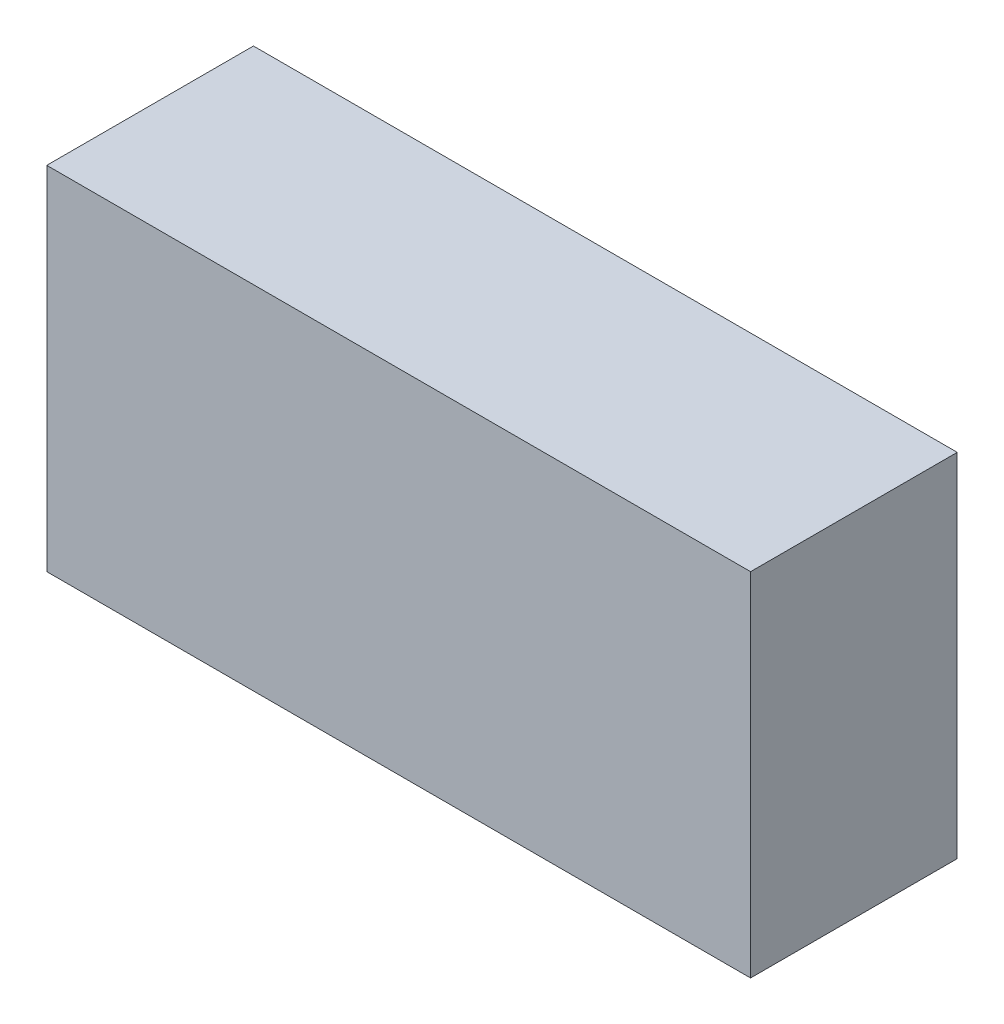
ISO-10303-21;
HEADER;
FILE_DESCRIPTION(('STEP AP214'),'2;1');
FILE_NAME('part.step','',(''),(''),'','','');
FILE_SCHEMA(('AUTOMOTIVE_DESIGN { 1 0 10303 214 1 1 1 1 }'));
ENDSEC;
DATA;
#1=APPLICATION_CONTEXT('core data for automotive mechanical design processes');
#2=APPLICATION_PROTOCOL_DEFINITION('international standard','automotive_design',2000,#1);
#3=PRODUCT_CONTEXT('',#1,'mechanical');
#4=PRODUCT('Part','Part','',(#3));
#5=PRODUCT_RELATED_PRODUCT_CATEGORY('part','',(#4));
#6=PRODUCT_DEFINITION_FORMATION('','',#4);
#7=PRODUCT_DEFINITION_CONTEXT('part definition',#1,'design');
#8=PRODUCT_DEFINITION('design','',#6,#7);
#9=PRODUCT_DEFINITION_SHAPE('','',#8);
#10=(LENGTH_UNIT() NAMED_UNIT(*) SI_UNIT(.MILLI.,.METRE.));
#11=(NAMED_UNIT(*) PLANE_ANGLE_UNIT() SI_UNIT($,.RADIAN.));
#12=(NAMED_UNIT(*) SI_UNIT($,.STERADIAN.) SOLID_ANGLE_UNIT());
#13=UNCERTAINTY_MEASURE_WITH_UNIT(LENGTH_MEASURE(1.E-05),#10,'distance_accuracy_value','');
#14=(GEOMETRIC_REPRESENTATION_CONTEXT(3) GLOBAL_UNCERTAINTY_ASSIGNED_CONTEXT((#13)) GLOBAL_UNIT_ASSIGNED_CONTEXT((#10,
#11,#12)) REPRESENTATION_CONTEXT('',''));
#15=CARTESIAN_POINT('',(0.,0.,0.));
#16=DIRECTION('',(0.,0.,1.));
#17=DIRECTION('',(1.,0.,0.));
#18=AXIS2_PLACEMENT_3D('',#15,#16,#17);
#19=CARTESIAN_POINT('',(-1.60020254,0.80010508,0.));
#20=DIRECTION('',(0.,1.,0.));
#21=DIRECTION('',(1.,0.,0.));
#22=AXIS2_PLACEMENT_3D('',#19,#20,#21);
#23=PLANE('',#22);
#24=DIRECTION('',(0.,0.,1.));
#25=VECTOR('',#24,1.);
#26=CARTESIAN_POINT('',(-1.60020254,0.80010508,0.));
#27=LINE('',#26,#25);
#28=CARTESIAN_POINT('',(-1.60020254,0.80010508,0.));
#29=VERTEX_POINT('',#28);
#30=CARTESIAN_POINT('',(-1.60020254,0.80010508,0.9398));
#31=VERTEX_POINT('',#30);
#32=EDGE_CURVE('E11',#29,#31,#27,.T.);
#33=ORIENTED_EDGE('',*,*,#32,.T.);
#34=DIRECTION('',(1.,0.,0.));
#35=VECTOR('',#34,1.);
#36=CARTESIAN_POINT('',(-1.60020254,0.80010508,0.9398));
#37=LINE('',#36,#35);
#38=CARTESIAN_POINT('',(1.60020254,0.80010508,0.9398));
#39=VERTEX_POINT('',#38);
#40=EDGE_CURVE('E24',#31,#39,#37,.T.);
#41=ORIENTED_EDGE('',*,*,#40,.T.);
#42=DIRECTION('',(0.,0.,1.));
#43=VECTOR('',#42,1.);
#44=CARTESIAN_POINT('',(1.60020254,0.80010508,0.));
#45=LINE('',#44,#43);
#46=CARTESIAN_POINT('',(1.60020254,0.80010508,0.));
#47=VERTEX_POINT('',#46);
#48=EDGE_CURVE('E85',#47,#39,#45,.T.);
#49=ORIENTED_EDGE('',*,*,#48,.F.);
#50=DIRECTION('',(1.,0.,0.));
#51=VECTOR('',#50,1.);
#52=CARTESIAN_POINT('',(-1.60020254,0.80010508,0.));
#53=LINE('',#52,#51);
#54=EDGE_CURVE('E83',#29,#47,#53,.T.);
#55=ORIENTED_EDGE('',*,*,#54,.F.);
#56=EDGE_LOOP('',(#33,#41,#49,#55));
#57=FACE_BOUND('',#56,.T.);
#58=ADVANCED_FACE('F17',(#57),#23,.T.);
#59=CARTESIAN_POINT('',(1.60020254,0.80010508,0.));
#60=DIRECTION('',(0.99999999999874,1.58730159430359E-06,0.));
#61=DIRECTION('',(1.58730159430359E-06,-0.99999999999874,0.));
#62=AXIS2_PLACEMENT_3D('',#59,#60,#61);
#63=PLANE('',#62);
#64=ORIENTED_EDGE('',*,*,#48,.T.);
#65=DIRECTION('',(1.58730159430359E-06,-0.99999999999874,0.));
#66=VECTOR('',#65,1.);
#67=CARTESIAN_POINT('',(1.60020254,0.80010508,0.9398));
#68=LINE('',#67,#66);
#69=CARTESIAN_POINT('',(1.60020508,-0.80009492,0.9398));
#70=VERTEX_POINT('',#69);
#71=EDGE_CURVE('E81',#39,#70,#68,.T.);
#72=ORIENTED_EDGE('',*,*,#71,.T.);
#73=DIRECTION('',(0.,0.,1.));
#74=VECTOR('',#73,1.);
#75=CARTESIAN_POINT('',(1.60020508,-0.80009492,0.));
#76=LINE('',#75,#74);
#77=CARTESIAN_POINT('',(1.60020508,-0.80009492,0.));
#78=VERTEX_POINT('',#77);
#79=EDGE_CURVE('E79',#78,#70,#76,.T.);
#80=ORIENTED_EDGE('',*,*,#79,.F.);
#81=DIRECTION('',(1.58730159430359E-06,-0.99999999999874,0.));
#82=VECTOR('',#81,1.);
#83=CARTESIAN_POINT('',(1.60020254,0.80010508,0.));
#84=LINE('',#83,#82);
#85=EDGE_CURVE('E70',#47,#78,#84,.T.);
#86=ORIENTED_EDGE('',*,*,#85,.F.);
#87=EDGE_LOOP('',(#64,#72,#80,#86));
#88=FACE_BOUND('',#87,.T.);
#89=ADVANCED_FACE('F90',(#88),#63,.T.);
#90=CARTESIAN_POINT('',(1.60020508,-0.80009492,0.));
#91=DIRECTION('',(2.38094859884839E-06,-0.999999999997166,0.));
#92=DIRECTION('',(-0.999999999997166,-2.38094859884839E-06,0.));
#93=AXIS2_PLACEMENT_3D('',#90,#91,#92);
#94=PLANE('',#93);
#95=ORIENTED_EDGE('',*,*,#79,.T.);
#96=DIRECTION('',(-0.999999999997166,-2.38094859884839E-06,0.));
#97=VECTOR('',#96,1.);
#98=CARTESIAN_POINT('',(1.60020508,-0.80009492,0.9398));
#99=LINE('',#98,#97);
#100=CARTESIAN_POINT('',(-1.6002,-0.80010254,0.9398));
#101=VERTEX_POINT('',#100);
#102=EDGE_CURVE('E60',#70,#101,#99,.T.);
#103=ORIENTED_EDGE('',*,*,#102,.T.);
#104=DIRECTION('',(0.,0.,1.));
#105=VECTOR('',#104,1.);
#106=CARTESIAN_POINT('',(-1.6002,-0.80010254,0.));
#107=LINE('',#106,#105);
#108=CARTESIAN_POINT('',(-1.6002,-0.80010254,0.));
#109=VERTEX_POINT('',#108);
#110=EDGE_CURVE('E54',#109,#101,#107,.T.);
#111=ORIENTED_EDGE('',*,*,#110,.F.);
#112=DIRECTION('',(-0.999999999997166,-2.38094859884839E-06,0.));
#113=VECTOR('',#112,1.);
#114=CARTESIAN_POINT('',(1.60020508,-0.80009492,0.));
#115=LINE('',#114,#113);
#116=EDGE_CURVE('E58',#78,#109,#115,.T.);
#117=ORIENTED_EDGE('',*,*,#116,.F.);
#118=EDGE_LOOP('',(#95,#103,#111,#117));
#119=FACE_BOUND('',#118,.T.);
#120=ADVANCED_FACE('F57',(#119),#94,.T.);
#121=CARTESIAN_POINT('',(-1.6002,-0.80010254,0.));
#122=DIRECTION('',(-0.99999999999874,-1.58729403576059E-06,0.));
#123=DIRECTION('',(-1.58729403576059E-06,0.99999999999874,0.));
#124=AXIS2_PLACEMENT_3D('',#121,#122,#123);
#125=PLANE('',#124);
#126=ORIENTED_EDGE('',*,*,#110,.T.);
#127=DIRECTION('',(-1.58729403576059E-06,0.99999999999874,0.));
#128=VECTOR('',#127,1.);
#129=CARTESIAN_POINT('',(-1.6002,-0.80010254,0.9398));
#130=LINE('',#129,#128);
#131=EDGE_CURVE('E71',#101,#31,#130,.T.);
#132=ORIENTED_EDGE('',*,*,#131,.T.);
#133=ORIENTED_EDGE('',*,*,#32,.F.);
#134=DIRECTION('',(-1.58729403576059E-06,0.99999999999874,0.));
#135=VECTOR('',#134,1.);
#136=CARTESIAN_POINT('',(-1.6002,-0.80010254,0.));
#137=LINE('',#136,#135);
#138=EDGE_CURVE('E68',#109,#29,#137,.T.);
#139=ORIENTED_EDGE('',*,*,#138,.F.);
#140=EDGE_LOOP('',(#126,#132,#133,#139));
#141=FACE_BOUND('',#140,.T.);
#142=ADVANCED_FACE('F73',(#141),#125,.T.);
#143=CARTESIAN_POINT('',(3.288849809461E-13,3.174997728391E-06,0.));
#144=DIRECTION('',(0.,0.,-1.));
#145=DIRECTION('',(-1.,0.,0.));
#146=AXIS2_PLACEMENT_3D('',#143,#144,#145);
#147=PLANE('',#146);
#148=ORIENTED_EDGE('',*,*,#54,.T.);
#149=ORIENTED_EDGE('',*,*,#85,.T.);
#150=ORIENTED_EDGE('',*,*,#116,.T.);
#151=ORIENTED_EDGE('',*,*,#138,.T.);
#152=EDGE_LOOP('',(#148,#149,#150,#151));
#153=FACE_BOUND('',#152,.T.);
#154=ADVANCED_FACE('F67',(#153),#147,.T.);
#155=CARTESIAN_POINT('',(3.288849809461E-13,3.174997728391E-06,0.9398));
#156=DIRECTION('',(0.,0.,-1.));
#157=DIRECTION('',(-1.,0.,0.));
#158=AXIS2_PLACEMENT_3D('',#155,#156,#157);
#159=PLANE('',#158);
#160=ORIENTED_EDGE('',*,*,#131,.F.);
#161=ORIENTED_EDGE('',*,*,#102,.F.);
#162=ORIENTED_EDGE('',*,*,#71,.F.);
#163=ORIENTED_EDGE('',*,*,#40,.F.);
#164=EDGE_LOOP('',(#160,#161,#162,#163));
#165=FACE_BOUND('',#164,.T.);
#166=ADVANCED_FACE('F91',(#165),#159,.F.);
#167=CLOSED_SHELL('',(#58,#89,#120,#142,#154,#166));
#168=MANIFOLD_SOLID_BREP('B1',#167);
#169=ADVANCED_BREP_SHAPE_REPRESENTATION('',(#18,#168),#14);
#170=SHAPE_DEFINITION_REPRESENTATION(#9,#169);
ENDSEC;
END-ISO-10303-21;
